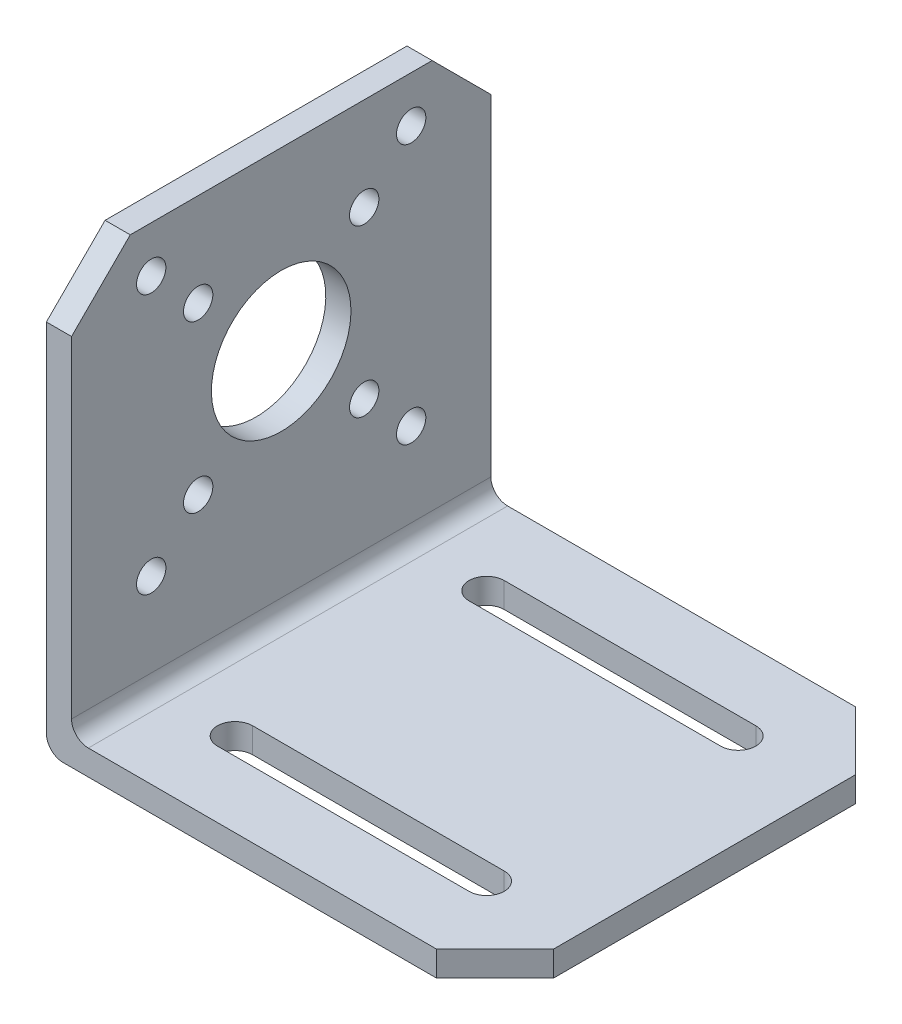
ISO-10303-21;
HEADER;
FILE_DESCRIPTION(('STEP AP214'),'2;1');
FILE_NAME('part.step','',(''),(''),'','','');
FILE_SCHEMA(('AUTOMOTIVE_DESIGN { 1 0 10303 214 1 1 1 1 }'));
ENDSEC;
DATA;
#1=APPLICATION_CONTEXT('core data for automotive mechanical design processes');
#2=APPLICATION_PROTOCOL_DEFINITION('international standard','automotive_design',2000,#1);
#3=PRODUCT_CONTEXT('',#1,'mechanical');
#4=PRODUCT('Part','Part','',(#3));
#5=PRODUCT_RELATED_PRODUCT_CATEGORY('part','',(#4));
#6=PRODUCT_DEFINITION_FORMATION('','',#4);
#7=PRODUCT_DEFINITION_CONTEXT('part definition',#1,'design');
#8=PRODUCT_DEFINITION('design','',#6,#7);
#9=PRODUCT_DEFINITION_SHAPE('','',#8);
#10=(LENGTH_UNIT() NAMED_UNIT(*) SI_UNIT(.MILLI.,.METRE.));
#11=(NAMED_UNIT(*) PLANE_ANGLE_UNIT() SI_UNIT($,.RADIAN.));
#12=(NAMED_UNIT(*) SI_UNIT($,.STERADIAN.) SOLID_ANGLE_UNIT());
#13=UNCERTAINTY_MEASURE_WITH_UNIT(LENGTH_MEASURE(1.E-05),#10,'distance_accuracy_value','');
#14=(GEOMETRIC_REPRESENTATION_CONTEXT(3) GLOBAL_UNCERTAINTY_ASSIGNED_CONTEXT((#13)) GLOBAL_UNIT_ASSIGNED_CONTEXT((#10,
#11,#12)) REPRESENTATION_CONTEXT('',''));
#15=CARTESIAN_POINT('',(0.,0.,0.));
#16=DIRECTION('',(0.,0.,1.));
#17=DIRECTION('',(1.,0.,0.));
#18=AXIS2_PLACEMENT_3D('',#15,#16,#17);
#19=CARTESIAN_POINT('',(0.,51.5,50.));
#20=DIRECTION('',(0.,1.,0.));
#21=DIRECTION('',(0.,0.,1.));
#22=AXIS2_PLACEMENT_3D('',#19,#20,#21);
#23=PLANE('',#22);
#24=DIRECTION('',(0.,0.,-1.));
#25=VECTOR('',#24,1.);
#26=CARTESIAN_POINT('',(0.,51.5,50.));
#27=LINE('',#26,#25);
#28=CARTESIAN_POINT('',(0.,51.5,43.));
#29=VERTEX_POINT('',#28);
#30=CARTESIAN_POINT('',(0.,51.5,7.00000000000003));
#31=VERTEX_POINT('',#30);
#32=EDGE_CURVE('E325',#29,#31,#27,.T.);
#33=ORIENTED_EDGE('',*,*,#32,.F.);
#34=DIRECTION('',(1.,0.,0.));
#35=VECTOR('',#34,1.);
#36=CARTESIAN_POINT('',(3.,51.5,43.));
#37=LINE('',#36,#35);
#38=CARTESIAN_POINT('',(3.,51.5,43.));
#39=VERTEX_POINT('',#38);
#40=EDGE_CURVE('E375',#29,#39,#37,.T.);
#41=ORIENTED_EDGE('',*,*,#40,.T.);
#42=DIRECTION('',(0.,0.,-1.));
#43=VECTOR('',#42,1.);
#44=CARTESIAN_POINT('',(3.,51.5,50.));
#45=LINE('',#44,#43);
#46=CARTESIAN_POINT('',(3.,51.5,7.00000000000003));
#47=VERTEX_POINT('',#46);
#48=EDGE_CURVE('E310',#39,#47,#45,.T.);
#49=ORIENTED_EDGE('',*,*,#48,.T.);
#50=DIRECTION('',(-1.,0.,0.));
#51=VECTOR('',#50,1.);
#52=CARTESIAN_POINT('',(0.,51.5,7.00000000000003));
#53=LINE('',#52,#51);
#54=EDGE_CURVE('E350',#47,#31,#53,.T.);
#55=ORIENTED_EDGE('',*,*,#54,.T.);
#56=EDGE_LOOP('',(#33,#41,#49,#55));
#57=FACE_BOUND('',#56,.T.);
#58=ADVANCED_FACE('F32',(#57),#23,.T.);
#59=CARTESIAN_POINT('',(0.,51.5,50.));
#60=DIRECTION('',(1.,0.,0.));
#61=DIRECTION('',(0.,1.,0.));
#62=AXIS2_PLACEMENT_3D('',#59,#60,#61);
#63=PLANE('',#62);
#64=CARTESIAN_POINT('',(0.,40.3994949366116,34.8994949366117));
#65=DIRECTION('',(1.,0.,0.));
#66=DIRECTION('',(0.,1.,0.));
#67=AXIS2_PLACEMENT_3D('',#64,#65,#66);
#68=CIRCLE('',#67,1.75);
#69=CARTESIAN_POINT('',(0.,42.1494949366116,34.8994949366117));
#70=VERTEX_POINT('',#69);
#71=EDGE_CURVE('E263',#70,#70,#68,.T.);
#72=ORIENTED_EDGE('',*,*,#71,.T.);
#73=EDGE_LOOP('',(#72));
#74=FACE_BOUND('',#73,.T.);
#75=CARTESIAN_POINT('',(0.,40.3994949366116,15.1005050633883));
#76=DIRECTION('',(1.,0.,0.));
#77=DIRECTION('',(0.,-1.,0.));
#78=AXIS2_PLACEMENT_3D('',#75,#76,#77);
#79=CIRCLE('',#78,1.75);
#80=CARTESIAN_POINT('',(0.,38.6494949366116,15.1005050633883));
#81=VERTEX_POINT('',#80);
#82=EDGE_CURVE('E270',#81,#81,#79,.T.);
#83=ORIENTED_EDGE('',*,*,#82,.T.);
#84=EDGE_LOOP('',(#83));
#85=FACE_BOUND('',#84,.T.);
#86=CARTESIAN_POINT('',(0.,20.6005050633884,15.1005050633883));
#87=DIRECTION('',(1.,0.,0.));
#88=DIRECTION('',(0.,1.,0.));
#89=AXIS2_PLACEMENT_3D('',#86,#87,#88);
#90=CIRCLE('',#89,1.75);
#91=CARTESIAN_POINT('',(0.,22.3505050633884,15.1005050633883));
#92=VERTEX_POINT('',#91);
#93=EDGE_CURVE('E276',#92,#92,#90,.T.);
#94=ORIENTED_EDGE('',*,*,#93,.T.);
#95=EDGE_LOOP('',(#94));
#96=FACE_BOUND('',#95,.T.);
#97=CARTESIAN_POINT('',(0.,20.6005050633884,34.8994949366117));
#98=DIRECTION('',(1.,0.,0.));
#99=DIRECTION('',(0.,-1.,0.));
#100=AXIS2_PLACEMENT_3D('',#97,#98,#99);
#101=CIRCLE('',#100,1.75);
#102=CARTESIAN_POINT('',(0.,18.8505050633884,34.8994949366117));
#103=VERTEX_POINT('',#102);
#104=EDGE_CURVE('E282',#103,#103,#101,.T.);
#105=ORIENTED_EDGE('',*,*,#104,.T.);
#106=EDGE_LOOP('',(#105));
#107=FACE_BOUND('',#106,.T.);
#108=CARTESIAN_POINT('',(0.,45.9999999999998,40.5));
#109=DIRECTION('',(1.,0.,0.));
#110=DIRECTION('',(0.,1.,0.));
#111=AXIS2_PLACEMENT_3D('',#108,#109,#110);
#112=CIRCLE('',#111,1.75);
#113=CARTESIAN_POINT('',(0.,47.7499999999998,40.5));
#114=VERTEX_POINT('',#113);
#115=EDGE_CURVE('E239',#114,#114,#112,.T.);
#116=ORIENTED_EDGE('',*,*,#115,.T.);
#117=EDGE_LOOP('',(#116));
#118=FACE_BOUND('',#117,.T.);
#119=CARTESIAN_POINT('',(0.,45.9999999999998,9.5));
#120=DIRECTION('',(1.,0.,0.));
#121=DIRECTION('',(0.,-1.,0.));
#122=AXIS2_PLACEMENT_3D('',#119,#120,#121);
#123=CIRCLE('',#122,1.75);
#124=CARTESIAN_POINT('',(0.,44.2499999999998,9.5));
#125=VERTEX_POINT('',#124);
#126=EDGE_CURVE('E246',#125,#125,#123,.T.);
#127=ORIENTED_EDGE('',*,*,#126,.T.);
#128=EDGE_LOOP('',(#127));
#129=FACE_BOUND('',#128,.T.);
#130=CARTESIAN_POINT('',(0.,15.0000000000002,40.5));
#131=DIRECTION('',(1.,0.,0.));
#132=DIRECTION('',(0.,-1.,0.));
#133=AXIS2_PLACEMENT_3D('',#130,#131,#132);
#134=CIRCLE('',#133,1.75000000000001);
#135=CARTESIAN_POINT('',(0.,13.2500000000002,40.5));
#136=VERTEX_POINT('',#135);
#137=EDGE_CURVE('E252',#136,#136,#134,.T.);
#138=ORIENTED_EDGE('',*,*,#137,.T.);
#139=EDGE_LOOP('',(#138));
#140=FACE_BOUND('',#139,.T.);
#141=CARTESIAN_POINT('',(0.,15.0000000000002,9.5));
#142=DIRECTION('',(1.,0.,0.));
#143=DIRECTION('',(0.,1.,0.));
#144=AXIS2_PLACEMENT_3D('',#141,#142,#143);
#145=CIRCLE('',#144,1.75);
#146=CARTESIAN_POINT('',(0.,16.7500000000002,9.5));
#147=VERTEX_POINT('',#146);
#148=EDGE_CURVE('E258',#147,#147,#145,.T.);
#149=ORIENTED_EDGE('',*,*,#148,.T.);
#150=EDGE_LOOP('',(#149));
#151=FACE_BOUND('',#150,.T.);
#152=CARTESIAN_POINT('',(0.,30.5,25.));
#153=DIRECTION('',(1.,0.,0.));
#154=DIRECTION('',(0.,1.,0.));
#155=AXIS2_PLACEMENT_3D('',#152,#153,#154);
#156=CIRCLE('',#155,8.32007499365595);
#157=CARTESIAN_POINT('',(0.,38.8200749936559,25.));
#158=VERTEX_POINT('',#157);
#159=EDGE_CURVE('E287',#158,#158,#156,.T.);
#160=ORIENTED_EDGE('',*,*,#159,.T.);
#161=EDGE_LOOP('',(#160));
#162=FACE_BOUND('',#161,.T.);
#163=DIRECTION('',(0.,-1.,0.));
#164=VECTOR('',#163,1.);
#165=CARTESIAN_POINT('',(0.,51.5,50.));
#166=LINE('',#165,#164);
#167=CARTESIAN_POINT('',(0.,44.5,50.));
#168=VERTEX_POINT('',#167);
#169=CARTESIAN_POINT('',(0.,2.,50.));
#170=VERTEX_POINT('',#169);
#171=EDGE_CURVE('E308',#168,#170,#166,.T.);
#172=ORIENTED_EDGE('',*,*,#171,.F.);
#173=DIRECTION('',(0.,0.707106781186549,-0.707106781186546));
#174=VECTOR('',#173,1.);
#175=CARTESIAN_POINT('',(0.,51.5,43.));
#176=LINE('',#175,#174);
#177=EDGE_CURVE('E11',#168,#29,#176,.T.);
#178=ORIENTED_EDGE('',*,*,#177,.T.);
#179=ORIENTED_EDGE('',*,*,#32,.T.);
#180=DIRECTION('',(0.,0.707106781186546,0.707106781186549));
#181=VECTOR('',#180,1.);
#182=CARTESIAN_POINT('',(0.,44.5,0.));
#183=LINE('',#182,#181);
#184=CARTESIAN_POINT('',(0.,44.5,0.));
#185=VERTEX_POINT('',#184);
#186=EDGE_CURVE('E353',#31,#185,#183,.F.);
#187=ORIENTED_EDGE('',*,*,#186,.T.);
#188=DIRECTION('',(0.,-1.,0.));
#189=VECTOR('',#188,1.);
#190=CARTESIAN_POINT('',(0.,51.5,0.));
#191=LINE('',#190,#189);
#192=CARTESIAN_POINT('',(0.,2.,0.));
#193=VERTEX_POINT('',#192);
#194=EDGE_CURVE('E296',#185,#193,#191,.T.);
#195=ORIENTED_EDGE('',*,*,#194,.T.);
#196=DIRECTION('',(0.,0.,-1.));
#197=VECTOR('',#196,1.);
#198=CARTESIAN_POINT('',(0.,2.,50.));
#199=LINE('',#198,#197);
#200=EDGE_CURVE('E328',#170,#193,#199,.T.);
#201=ORIENTED_EDGE('',*,*,#200,.F.);
#202=EDGE_LOOP('',(#172,#178,#179,#187,#195,#201));
#203=FACE_BOUND('',#202,.T.);
#204=ADVANCED_FACE('F393',(#74,#85,#96,#107,#118,#129,#140,#151,#162,#203),#63,.F.);
#205=CARTESIAN_POINT('',(2.00000000000001,2.,50.));
#206=DIRECTION('',(0.,0.,-1.));
#207=DIRECTION('',(-1.,0.,0.));
#208=AXIS2_PLACEMENT_3D('',#205,#206,#207);
#209=CYLINDRICAL_SURFACE('',#208,2.);
#210=CARTESIAN_POINT('',(2.00000000000001,2.,0.));
#211=DIRECTION('',(0.,0.,-1.));
#212=DIRECTION('',(-1.,0.,0.));
#213=AXIS2_PLACEMENT_3D('',#210,#211,#212);
#214=CIRCLE('',#213,2.);
#215=CARTESIAN_POINT('',(2.00000000000001,0.,0.));
#216=VERTEX_POINT('',#215);
#217=EDGE_CURVE('E321',#216,#193,#214,.T.);
#218=ORIENTED_EDGE('',*,*,#217,.F.);
#219=DIRECTION('',(0.,0.,-1.));
#220=VECTOR('',#219,1.);
#221=CARTESIAN_POINT('',(2.00000000000001,0.,50.));
#222=LINE('',#221,#220);
#223=CARTESIAN_POINT('',(2.00000000000001,0.,50.));
#224=VERTEX_POINT('',#223);
#225=EDGE_CURVE('E331',#224,#216,#222,.T.);
#226=ORIENTED_EDGE('',*,*,#225,.F.);
#227=CARTESIAN_POINT('',(2.00000000000001,2.,50.));
#228=DIRECTION('',(0.,0.,-1.));
#229=DIRECTION('',(-1.,0.,0.));
#230=AXIS2_PLACEMENT_3D('',#227,#228,#229);
#231=CIRCLE('',#230,2.);
#232=EDGE_CURVE('E305',#224,#170,#231,.T.);
#233=ORIENTED_EDGE('',*,*,#232,.T.);
#234=ORIENTED_EDGE('',*,*,#200,.T.);
#235=EDGE_LOOP('',(#218,#226,#233,#234));
#236=FACE_BOUND('',#235,.T.);
#237=ADVANCED_FACE('F408',(#236),#209,.T.);
#238=CARTESIAN_POINT('',(2.00000000000001,0.,50.));
#239=DIRECTION('',(0.,1.,0.));
#240=DIRECTION('',(0.,0.,1.));
#241=AXIS2_PLACEMENT_3D('',#238,#239,#240);
#242=PLANE('',#241);
#243=DIRECTION('',(-1.,0.,0.));
#244=VECTOR('',#243,1.);
#245=CARTESIAN_POINT('',(2.00000000000001,0.,7.9));
#246=LINE('',#245,#244);
#247=CARTESIAN_POINT('',(42.5,0.,7.90000000000001));
#248=VERTEX_POINT('',#247);
#249=CARTESIAN_POINT('',(12.5,0.,7.9));
#250=VERTEX_POINT('',#249);
#251=EDGE_CURVE('E232',#248,#250,#246,.T.);
#252=ORIENTED_EDGE('',*,*,#251,.T.);
#253=CARTESIAN_POINT('',(12.5,0.,10.));
#254=DIRECTION('',(0.,1.,0.));
#255=DIRECTION('',(0.,0.,1.));
#256=AXIS2_PLACEMENT_3D('',#253,#254,#255);
#257=CIRCLE('',#256,2.1);
#258=CARTESIAN_POINT('',(12.5,0.,12.1));
#259=VERTEX_POINT('',#258);
#260=EDGE_CURVE('E235',#250,#259,#257,.T.);
#261=ORIENTED_EDGE('',*,*,#260,.T.);
#262=DIRECTION('',(1.,0.,0.));
#263=VECTOR('',#262,1.);
#264=CARTESIAN_POINT('',(2.00000000000001,0.,12.1));
#265=LINE('',#264,#263);
#266=CARTESIAN_POINT('',(42.5,0.,12.1));
#267=VERTEX_POINT('',#266);
#268=EDGE_CURVE('E229',#259,#267,#265,.T.);
#269=ORIENTED_EDGE('',*,*,#268,.T.);
#270=CARTESIAN_POINT('',(42.5,0.,10.));
#271=DIRECTION('',(0.,1.,0.));
#272=DIRECTION('',(0.,0.,1.));
#273=AXIS2_PLACEMENT_3D('',#270,#271,#272);
#274=CIRCLE('',#273,2.1);
#275=EDGE_CURVE('E173',#267,#248,#274,.T.);
#276=ORIENTED_EDGE('',*,*,#275,.T.);
#277=EDGE_LOOP('',(#252,#261,#269,#276));
#278=FACE_BOUND('',#277,.T.);
#279=DIRECTION('',(-1.,0.,0.));
#280=VECTOR('',#279,1.);
#281=CARTESIAN_POINT('',(2.00000000000001,0.,37.9));
#282=LINE('',#281,#280);
#283=CARTESIAN_POINT('',(42.5,0.,37.9));
#284=VERTEX_POINT('',#283);
#285=CARTESIAN_POINT('',(12.5,0.,37.9));
#286=VERTEX_POINT('',#285);
#287=EDGE_CURVE('E223',#284,#286,#282,.T.);
#288=ORIENTED_EDGE('',*,*,#287,.T.);
#289=CARTESIAN_POINT('',(12.5,0.,40.));
#290=DIRECTION('',(0.,1.,0.));
#291=DIRECTION('',(0.,0.,1.));
#292=AXIS2_PLACEMENT_3D('',#289,#290,#291);
#293=CIRCLE('',#292,2.1);
#294=CARTESIAN_POINT('',(12.5,0.,42.1));
#295=VERTEX_POINT('',#294);
#296=EDGE_CURVE('E226',#286,#295,#293,.T.);
#297=ORIENTED_EDGE('',*,*,#296,.T.);
#298=DIRECTION('',(1.,0.,0.));
#299=VECTOR('',#298,1.);
#300=CARTESIAN_POINT('',(2.00000000000001,0.,42.1));
#301=LINE('',#300,#299);
#302=CARTESIAN_POINT('',(42.5,0.,42.1));
#303=VERTEX_POINT('',#302);
#304=EDGE_CURVE('E197',#295,#303,#301,.T.);
#305=ORIENTED_EDGE('',*,*,#304,.T.);
#306=CARTESIAN_POINT('',(42.5,0.,40.));
#307=DIRECTION('',(0.,1.,0.));
#308=DIRECTION('',(0.,0.,1.));
#309=AXIS2_PLACEMENT_3D('',#306,#307,#308);
#310=CIRCLE('',#309,2.1);
#311=EDGE_CURVE('E220',#303,#284,#310,.T.);
#312=ORIENTED_EDGE('',*,*,#311,.T.);
#313=EDGE_LOOP('',(#288,#297,#305,#312));
#314=FACE_BOUND('',#313,.T.);
#315=DIRECTION('',(1.,0.,0.));
#316=VECTOR('',#315,1.);
#317=CARTESIAN_POINT('',(2.00000000000001,0.,0.));
#318=LINE('',#317,#316);
#319=CARTESIAN_POINT('',(46.5,0.,0.));
#320=VERTEX_POINT('',#319);
#321=EDGE_CURVE('E318',#216,#320,#318,.T.);
#322=ORIENTED_EDGE('',*,*,#321,.T.);
#323=DIRECTION('',(-0.707106781186546,0.,-0.707106781186549));
#324=VECTOR('',#323,1.);
#325=CARTESIAN_POINT('',(46.5,0.,0.));
#326=LINE('',#325,#324);
#327=CARTESIAN_POINT('',(53.5,0.,7.00000000000003));
#328=VERTEX_POINT('',#327);
#329=EDGE_CURVE('E360',#320,#328,#326,.F.);
#330=ORIENTED_EDGE('',*,*,#329,.T.);
#331=DIRECTION('',(0.,0.,-1.));
#332=VECTOR('',#331,1.);
#333=CARTESIAN_POINT('',(53.5,0.,50.));
#334=LINE('',#333,#332);
#335=CARTESIAN_POINT('',(53.5,0.,43.));
#336=VERTEX_POINT('',#335);
#337=EDGE_CURVE('E333',#336,#328,#334,.T.);
#338=ORIENTED_EDGE('',*,*,#337,.F.);
#339=DIRECTION('',(-0.707106781186549,0.,0.707106781186546));
#340=VECTOR('',#339,1.);
#341=CARTESIAN_POINT('',(53.5,0.,43.));
#342=LINE('',#341,#340);
#343=CARTESIAN_POINT('',(46.5,0.,50.));
#344=VERTEX_POINT('',#343);
#345=EDGE_CURVE('E358',#336,#344,#342,.T.);
#346=ORIENTED_EDGE('',*,*,#345,.T.);
#347=DIRECTION('',(1.,0.,0.));
#348=VECTOR('',#347,1.);
#349=CARTESIAN_POINT('',(2.00000000000001,0.,50.));
#350=LINE('',#349,#348);
#351=EDGE_CURVE('E302',#224,#344,#350,.T.);
#352=ORIENTED_EDGE('',*,*,#351,.F.);
#353=ORIENTED_EDGE('',*,*,#225,.T.);
#354=EDGE_LOOP('',(#322,#330,#338,#346,#352,#353));
#355=FACE_BOUND('',#354,.T.);
#356=ADVANCED_FACE('F514',(#278,#314,#355),#242,.F.);
#357=CARTESIAN_POINT('',(53.5,3.,50.));
#358=DIRECTION('',(1.,0.,0.));
#359=DIRECTION('',(0.,0.,-1.));
#360=AXIS2_PLACEMENT_3D('',#357,#358,#359);
#361=PLANE('',#360);
#362=ORIENTED_EDGE('',*,*,#337,.T.);
#363=DIRECTION('',(0.,1.,0.));
#364=VECTOR('',#363,1.);
#365=CARTESIAN_POINT('',(53.5,3.,7.00000000000003));
#366=LINE('',#365,#364);
#367=CARTESIAN_POINT('',(53.5,3.,7.00000000000003));
#368=VERTEX_POINT('',#367);
#369=EDGE_CURVE('E365',#328,#368,#366,.T.);
#370=ORIENTED_EDGE('',*,*,#369,.T.);
#371=DIRECTION('',(0.,0.,-1.));
#372=VECTOR('',#371,1.);
#373=CARTESIAN_POINT('',(53.5,3.,50.));
#374=LINE('',#373,#372);
#375=CARTESIAN_POINT('',(53.5,3.,43.));
#376=VERTEX_POINT('',#375);
#377=EDGE_CURVE('E336',#376,#368,#374,.T.);
#378=ORIENTED_EDGE('',*,*,#377,.F.);
#379=DIRECTION('',(0.,-1.,0.));
#380=VECTOR('',#379,1.);
#381=CARTESIAN_POINT('',(53.5,0.,43.));
#382=LINE('',#381,#380);
#383=EDGE_CURVE('E362',#376,#336,#382,.T.);
#384=ORIENTED_EDGE('',*,*,#383,.T.);
#385=EDGE_LOOP('',(#362,#370,#378,#384));
#386=FACE_BOUND('',#385,.T.);
#387=ADVANCED_FACE('F421',(#386),#361,.T.);
#388=CARTESIAN_POINT('',(5.,2.99999999999997,50.));
#389=DIRECTION('',(0.,1.,0.));
#390=DIRECTION('',(-1.,0.,0.));
#391=AXIS2_PLACEMENT_3D('',#388,#389,#390);
#392=PLANE('',#391);
#393=CARTESIAN_POINT('',(12.5,2.99999999999998,10.));
#394=DIRECTION('',(0.,1.,0.));
#395=DIRECTION('',(-1.,0.,0.));
#396=AXIS2_PLACEMENT_3D('',#393,#394,#395);
#397=CIRCLE('',#396,2.1);
#398=CARTESIAN_POINT('',(12.5,2.99999999999998,7.9));
#399=VERTEX_POINT('',#398);
#400=CARTESIAN_POINT('',(12.5,2.99999999999998,12.1));
#401=VERTEX_POINT('',#400);
#402=EDGE_CURVE('E185',#399,#401,#397,.T.);
#403=ORIENTED_EDGE('',*,*,#402,.F.);
#404=DIRECTION('',(-1.,0.,0.));
#405=VECTOR('',#404,1.);
#406=CARTESIAN_POINT('',(12.5,2.99999999999998,7.9));
#407=LINE('',#406,#405);
#408=CARTESIAN_POINT('',(42.5,2.99999999999999,7.90000000000001));
#409=VERTEX_POINT('',#408);
#410=EDGE_CURVE('E190',#409,#399,#407,.T.);
#411=ORIENTED_EDGE('',*,*,#410,.F.);
#412=CARTESIAN_POINT('',(42.5,2.99999999999999,10.));
#413=DIRECTION('',(0.,1.,0.));
#414=DIRECTION('',(-1.,0.,0.));
#415=AXIS2_PLACEMENT_3D('',#412,#413,#414);
#416=CIRCLE('',#415,2.1);
#417=CARTESIAN_POINT('',(42.5,2.99999999999999,12.1));
#418=VERTEX_POINT('',#417);
#419=EDGE_CURVE('E170',#418,#409,#416,.T.);
#420=ORIENTED_EDGE('',*,*,#419,.F.);
#421=DIRECTION('',(1.,0.,0.));
#422=VECTOR('',#421,1.);
#423=CARTESIAN_POINT('',(12.5,2.99999999999998,12.1));
#424=LINE('',#423,#422);
#425=EDGE_CURVE('E180',#401,#418,#424,.T.);
#426=ORIENTED_EDGE('',*,*,#425,.F.);
#427=EDGE_LOOP('',(#403,#411,#420,#426));
#428=FACE_BOUND('',#427,.T.);
#429=CARTESIAN_POINT('',(12.5,2.99999999999998,40.));
#430=DIRECTION('',(0.,1.,0.));
#431=DIRECTION('',(1.,0.,0.));
#432=AXIS2_PLACEMENT_3D('',#429,#430,#431);
#433=CIRCLE('',#432,2.1);
#434=CARTESIAN_POINT('',(12.5,2.99999999999998,37.9));
#435=VERTEX_POINT('',#434);
#436=CARTESIAN_POINT('',(12.5,2.99999999999998,42.1));
#437=VERTEX_POINT('',#436);
#438=EDGE_CURVE('E200',#435,#437,#433,.T.);
#439=ORIENTED_EDGE('',*,*,#438,.F.);
#440=DIRECTION('',(-1.,0.,0.));
#441=VECTOR('',#440,1.);
#442=CARTESIAN_POINT('',(12.5,2.99999999999998,37.9));
#443=LINE('',#442,#441);
#444=CARTESIAN_POINT('',(42.5,2.99999999999999,37.9));
#445=VERTEX_POINT('',#444);
#446=EDGE_CURVE('E207',#445,#435,#443,.T.);
#447=ORIENTED_EDGE('',*,*,#446,.F.);
#448=CARTESIAN_POINT('',(42.5,2.99999999999999,40.));
#449=DIRECTION('',(0.,1.,0.));
#450=DIRECTION('',(1.,0.,0.));
#451=AXIS2_PLACEMENT_3D('',#448,#449,#450);
#452=CIRCLE('',#451,2.1);
#453=CARTESIAN_POINT('',(42.5,2.99999999999999,42.1));
#454=VERTEX_POINT('',#453);
#455=EDGE_CURVE('E204',#454,#445,#452,.T.);
#456=ORIENTED_EDGE('',*,*,#455,.F.);
#457=DIRECTION('',(1.,0.,0.));
#458=VECTOR('',#457,1.);
#459=CARTESIAN_POINT('',(12.5,2.99999999999998,42.1));
#460=LINE('',#459,#458);
#461=EDGE_CURVE('E202',#437,#454,#460,.T.);
#462=ORIENTED_EDGE('',*,*,#461,.F.);
#463=EDGE_LOOP('',(#439,#447,#456,#462));
#464=FACE_BOUND('',#463,.T.);
#465=ORIENTED_EDGE('',*,*,#377,.T.);
#466=DIRECTION('',(0.707106781186546,0.,0.707106781186549));
#467=VECTOR('',#466,1.);
#468=CARTESIAN_POINT('',(50.7500000000001,3.,4.25000000000011));
#469=LINE('',#468,#467);
#470=CARTESIAN_POINT('',(46.5,3.,0.));
#471=VERTEX_POINT('',#470);
#472=EDGE_CURVE('E369',#368,#471,#469,.F.);
#473=ORIENTED_EDGE('',*,*,#472,.T.);
#474=DIRECTION('',(1.,0.,0.));
#475=VECTOR('',#474,1.);
#476=CARTESIAN_POINT('',(5.,2.99999999999997,0.));
#477=LINE('',#476,#475);
#478=CARTESIAN_POINT('',(5.,2.99999999999997,0.));
#479=VERTEX_POINT('',#478);
#480=EDGE_CURVE('E315',#479,#471,#477,.T.);
#481=ORIENTED_EDGE('',*,*,#480,.F.);
#482=DIRECTION('',(0.,0.,-1.));
#483=VECTOR('',#482,1.);
#484=CARTESIAN_POINT('',(5.,2.99999999999997,50.));
#485=LINE('',#484,#483);
#486=CARTESIAN_POINT('',(5.,2.99999999999997,50.));
#487=VERTEX_POINT('',#486);
#488=EDGE_CURVE('E339',#487,#479,#485,.T.);
#489=ORIENTED_EDGE('',*,*,#488,.F.);
#490=DIRECTION('',(1.,0.,0.));
#491=VECTOR('',#490,1.);
#492=CARTESIAN_POINT('',(5.,2.99999999999997,50.));
#493=LINE('',#492,#491);
#494=CARTESIAN_POINT('',(46.5,3.,50.));
#495=VERTEX_POINT('',#494);
#496=EDGE_CURVE('E299',#487,#495,#493,.T.);
#497=ORIENTED_EDGE('',*,*,#496,.T.);
#498=DIRECTION('',(0.707106781186549,0.,-0.707106781186546));
#499=VECTOR('',#498,1.);
#500=CARTESIAN_POINT('',(25.7499999999999,2.99999999999998,70.75));
#501=LINE('',#500,#499);
#502=EDGE_CURVE('E367',#495,#376,#501,.T.);
#503=ORIENTED_EDGE('',*,*,#502,.T.);
#504=EDGE_LOOP('',(#465,#473,#481,#489,#497,#503));
#505=FACE_BOUND('',#504,.T.);
#506=ADVANCED_FACE('F187',(#428,#464,#505),#392,.T.);
#507=CARTESIAN_POINT('',(5.,4.99999999999997,50.));
#508=DIRECTION('',(0.,0.,-1.));
#509=DIRECTION('',(-1.,0.,0.));
#510=AXIS2_PLACEMENT_3D('',#507,#508,#509);
#511=CYLINDRICAL_SURFACE('',#510,2.);
#512=CARTESIAN_POINT('',(5.,4.99999999999997,0.));
#513=DIRECTION('',(0.,0.,-1.));
#514=DIRECTION('',(-1.,0.,0.));
#515=AXIS2_PLACEMENT_3D('',#512,#513,#514);
#516=CIRCLE('',#515,2.);
#517=CARTESIAN_POINT('',(3.00000000000001,4.99999999999997,0.));
#518=VERTEX_POINT('',#517);
#519=EDGE_CURVE('E312',#479,#518,#516,.T.);
#520=ORIENTED_EDGE('',*,*,#519,.T.);
#521=DIRECTION('',(0.,0.,-1.));
#522=VECTOR('',#521,1.);
#523=CARTESIAN_POINT('',(3.00000000000001,4.99999999999997,50.));
#524=LINE('',#523,#522);
#525=CARTESIAN_POINT('',(3.00000000000001,4.99999999999997,50.));
#526=VERTEX_POINT('',#525);
#527=EDGE_CURVE('E341',#526,#518,#524,.T.);
#528=ORIENTED_EDGE('',*,*,#527,.F.);
#529=CARTESIAN_POINT('',(5.,4.99999999999997,50.));
#530=DIRECTION('',(0.,0.,-1.));
#531=DIRECTION('',(-1.,0.,0.));
#532=AXIS2_PLACEMENT_3D('',#529,#530,#531);
#533=CIRCLE('',#532,2.);
#534=EDGE_CURVE('E295',#487,#526,#533,.T.);
#535=ORIENTED_EDGE('',*,*,#534,.F.);
#536=ORIENTED_EDGE('',*,*,#488,.T.);
#537=EDGE_LOOP('',(#520,#528,#535,#536));
#538=FACE_BOUND('',#537,.T.);
#539=ADVANCED_FACE('F430',(#538),#511,.F.);
#540=CARTESIAN_POINT('',(3.,51.5,50.));
#541=DIRECTION('',(1.,0.,0.));
#542=DIRECTION('',(0.,1.,0.));
#543=AXIS2_PLACEMENT_3D('',#540,#541,#542);
#544=PLANE('',#543);
#545=CARTESIAN_POINT('',(3.,40.3994949366116,34.8994949366117));
#546=DIRECTION('',(1.,0.,0.));
#547=DIRECTION('',(0.,1.,0.));
#548=AXIS2_PLACEMENT_3D('',#545,#546,#547);
#549=CIRCLE('',#548,1.75);
#550=CARTESIAN_POINT('',(3.,42.1494949366116,34.8994949366117));
#551=VERTEX_POINT('',#550);
#552=EDGE_CURVE('E267',#551,#551,#549,.T.);
#553=ORIENTED_EDGE('',*,*,#552,.F.);
#554=EDGE_LOOP('',(#553));
#555=FACE_BOUND('',#554,.T.);
#556=CARTESIAN_POINT('',(3.,40.3994949366116,15.1005050633883));
#557=DIRECTION('',(1.,0.,0.));
#558=DIRECTION('',(0.,-1.,0.));
#559=AXIS2_PLACEMENT_3D('',#556,#557,#558);
#560=CIRCLE('',#559,1.75);
#561=CARTESIAN_POINT('',(3.,38.6494949366116,15.1005050633883));
#562=VERTEX_POINT('',#561);
#563=EDGE_CURVE('E273',#562,#562,#560,.T.);
#564=ORIENTED_EDGE('',*,*,#563,.F.);
#565=EDGE_LOOP('',(#564));
#566=FACE_BOUND('',#565,.T.);
#567=CARTESIAN_POINT('',(3.,20.6005050633884,15.1005050633883));
#568=DIRECTION('',(1.,0.,0.));
#569=DIRECTION('',(0.,1.,0.));
#570=AXIS2_PLACEMENT_3D('',#567,#568,#569);
#571=CIRCLE('',#570,1.75);
#572=CARTESIAN_POINT('',(3.,22.3505050633884,15.1005050633883));
#573=VERTEX_POINT('',#572);
#574=EDGE_CURVE('E279',#573,#573,#571,.T.);
#575=ORIENTED_EDGE('',*,*,#574,.F.);
#576=EDGE_LOOP('',(#575));
#577=FACE_BOUND('',#576,.T.);
#578=CARTESIAN_POINT('',(3.,20.6005050633884,34.8994949366117));
#579=DIRECTION('',(1.,0.,0.));
#580=DIRECTION('',(0.,-1.,0.));
#581=AXIS2_PLACEMENT_3D('',#578,#579,#580);
#582=CIRCLE('',#581,1.75);
#583=CARTESIAN_POINT('',(3.,18.8505050633884,34.8994949366117));
#584=VERTEX_POINT('',#583);
#585=EDGE_CURVE('E242',#584,#584,#582,.T.);
#586=ORIENTED_EDGE('',*,*,#585,.F.);
#587=EDGE_LOOP('',(#586));
#588=FACE_BOUND('',#587,.T.);
#589=CARTESIAN_POINT('',(3.,45.9999999999998,40.5));
#590=DIRECTION('',(1.,0.,0.));
#591=DIRECTION('',(0.,1.,0.));
#592=AXIS2_PLACEMENT_3D('',#589,#590,#591);
#593=CIRCLE('',#592,1.75);
#594=CARTESIAN_POINT('',(3.,47.7499999999998,40.5));
#595=VERTEX_POINT('',#594);
#596=EDGE_CURVE('E243',#595,#595,#593,.T.);
#597=ORIENTED_EDGE('',*,*,#596,.F.);
#598=EDGE_LOOP('',(#597));
#599=FACE_BOUND('',#598,.T.);
#600=CARTESIAN_POINT('',(3.,45.9999999999998,9.5));
#601=DIRECTION('',(1.,0.,0.));
#602=DIRECTION('',(0.,-1.,0.));
#603=AXIS2_PLACEMENT_3D('',#600,#601,#602);
#604=CIRCLE('',#603,1.75);
#605=CARTESIAN_POINT('',(3.,44.2499999999998,9.5));
#606=VERTEX_POINT('',#605);
#607=EDGE_CURVE('E249',#606,#606,#604,.T.);
#608=ORIENTED_EDGE('',*,*,#607,.F.);
#609=EDGE_LOOP('',(#608));
#610=FACE_BOUND('',#609,.T.);
#611=CARTESIAN_POINT('',(3.00000000000001,15.0000000000002,40.5));
#612=DIRECTION('',(1.,0.,0.));
#613=DIRECTION('',(0.,-1.,0.));
#614=AXIS2_PLACEMENT_3D('',#611,#612,#613);
#615=CIRCLE('',#614,1.75000000000001);
#616=CARTESIAN_POINT('',(3.00000000000001,13.2500000000002,40.5));
#617=VERTEX_POINT('',#616);
#618=EDGE_CURVE('E255',#617,#617,#615,.T.);
#619=ORIENTED_EDGE('',*,*,#618,.F.);
#620=EDGE_LOOP('',(#619));
#621=FACE_BOUND('',#620,.T.);
#622=CARTESIAN_POINT('',(3.00000000000001,15.0000000000002,9.5));
#623=DIRECTION('',(1.,0.,0.));
#624=DIRECTION('',(0.,1.,0.));
#625=AXIS2_PLACEMENT_3D('',#622,#623,#624);
#626=CIRCLE('',#625,1.75);
#627=CARTESIAN_POINT('',(3.,16.7500000000002,9.5));
#628=VERTEX_POINT('',#627);
#629=EDGE_CURVE('E238',#628,#628,#626,.T.);
#630=ORIENTED_EDGE('',*,*,#629,.F.);
#631=EDGE_LOOP('',(#630));
#632=FACE_BOUND('',#631,.T.);
#633=CARTESIAN_POINT('',(3.,30.5,25.));
#634=DIRECTION('',(1.,0.,0.));
#635=DIRECTION('',(0.,1.,0.));
#636=AXIS2_PLACEMENT_3D('',#633,#634,#635);
#637=CIRCLE('',#636,8.32007499365595);
#638=CARTESIAN_POINT('',(3.,38.8200749936559,25.));
#639=VERTEX_POINT('',#638);
#640=EDGE_CURVE('E266',#639,#639,#637,.T.);
#641=ORIENTED_EDGE('',*,*,#640,.F.);
#642=EDGE_LOOP('',(#641));
#643=FACE_BOUND('',#642,.T.);
#644=ORIENTED_EDGE('',*,*,#48,.F.);
#645=DIRECTION('',(0.,-0.707106781186549,0.707106781186546));
#646=VECTOR('',#645,1.);
#647=CARTESIAN_POINT('',(3.,48.,46.5));
#648=LINE('',#647,#646);
#649=CARTESIAN_POINT('',(3.,44.5,50.));
#650=VERTEX_POINT('',#649);
#651=EDGE_CURVE('E40',#39,#650,#648,.T.);
#652=ORIENTED_EDGE('',*,*,#651,.T.);
#653=DIRECTION('',(0.,-1.,0.));
#654=VECTOR('',#653,1.);
#655=CARTESIAN_POINT('',(3.,51.5,50.));
#656=LINE('',#655,#654);
#657=EDGE_CURVE('E293',#650,#526,#656,.T.);
#658=ORIENTED_EDGE('',*,*,#657,.T.);
#659=ORIENTED_EDGE('',*,*,#527,.T.);
#660=DIRECTION('',(0.,-1.,0.));
#661=VECTOR('',#660,1.);
#662=CARTESIAN_POINT('',(3.,51.5,0.));
#663=LINE('',#662,#661);
#664=CARTESIAN_POINT('',(3.,44.5,0.));
#665=VERTEX_POINT('',#664);
#666=EDGE_CURVE('E290',#665,#518,#663,.T.);
#667=ORIENTED_EDGE('',*,*,#666,.F.);
#668=DIRECTION('',(0.,-0.707106781186546,-0.707106781186549));
#669=VECTOR('',#668,1.);
#670=CARTESIAN_POINT('',(3.,73.,28.5000000000001));
#671=LINE('',#670,#669);
#672=EDGE_CURVE('E347',#665,#47,#671,.F.);
#673=ORIENTED_EDGE('',*,*,#672,.T.);
#674=EDGE_LOOP('',(#644,#652,#658,#659,#667,#673));
#675=FACE_BOUND('',#674,.T.);
#676=ADVANCED_FACE('F380',(#555,#566,#577,#588,#599,#610,#621,#632,#643,#675),#544,.T.);
#677=CARTESIAN_POINT('',(5.,4.99999999999997,50.));
#678=DIRECTION('',(0.,0.,-1.));
#679=DIRECTION('',(-1.,0.,0.));
#680=AXIS2_PLACEMENT_3D('',#677,#678,#679);
#681=PLANE('',#680);
#682=ORIENTED_EDGE('',*,*,#351,.T.);
#683=DIRECTION('',(0.,1.,0.));
#684=VECTOR('',#683,1.);
#685=CARTESIAN_POINT('',(46.5,3.,50.));
#686=LINE('',#685,#684);
#687=EDGE_CURVE('E373',#344,#495,#686,.T.);
#688=ORIENTED_EDGE('',*,*,#687,.T.);
#689=ORIENTED_EDGE('',*,*,#496,.F.);
#690=ORIENTED_EDGE('',*,*,#534,.T.);
#691=ORIENTED_EDGE('',*,*,#657,.F.);
#692=DIRECTION('',(-1.,0.,0.));
#693=VECTOR('',#692,1.);
#694=CARTESIAN_POINT('',(0.,44.5,50.));
#695=LINE('',#694,#693);
#696=EDGE_CURVE('E371',#650,#168,#695,.T.);
#697=ORIENTED_EDGE('',*,*,#696,.T.);
#698=ORIENTED_EDGE('',*,*,#171,.T.);
#699=ORIENTED_EDGE('',*,*,#232,.F.);
#700=EDGE_LOOP('',(#682,#688,#689,#690,#691,#697,#698,#699));
#701=FACE_BOUND('',#700,.T.);
#702=ADVANCED_FACE('F385',(#701),#681,.F.);
#703=CARTESIAN_POINT('',(5.,4.99999999999997,0.));
#704=DIRECTION('',(0.,0.,-1.));
#705=DIRECTION('',(-1.,0.,0.));
#706=AXIS2_PLACEMENT_3D('',#703,#704,#705);
#707=PLANE('',#706);
#708=ORIENTED_EDGE('',*,*,#480,.T.);
#709=DIRECTION('',(0.,-1.,0.));
#710=VECTOR('',#709,1.);
#711=CARTESIAN_POINT('',(46.5,4.99999999999997,0.));
#712=LINE('',#711,#710);
#713=EDGE_CURVE('E355',#471,#320,#712,.T.);
#714=ORIENTED_EDGE('',*,*,#713,.T.);
#715=ORIENTED_EDGE('',*,*,#321,.F.);
#716=ORIENTED_EDGE('',*,*,#217,.T.);
#717=ORIENTED_EDGE('',*,*,#194,.F.);
#718=DIRECTION('',(1.,0.,0.));
#719=VECTOR('',#718,1.);
#720=CARTESIAN_POINT('',(5.,44.5,0.));
#721=LINE('',#720,#719);
#722=EDGE_CURVE('E327',#185,#665,#721,.T.);
#723=ORIENTED_EDGE('',*,*,#722,.T.);
#724=ORIENTED_EDGE('',*,*,#666,.T.);
#725=ORIENTED_EDGE('',*,*,#519,.F.);
#726=EDGE_LOOP('',(#708,#714,#715,#716,#717,#723,#724,#725));
#727=FACE_BOUND('',#726,.T.);
#728=ADVANCED_FACE('F403',(#727),#707,.T.);
#729=CARTESIAN_POINT('',(0.,30.5,25.));
#730=DIRECTION('',(1.,0.,0.));
#731=DIRECTION('',(0.,1.,0.));
#732=AXIS2_PLACEMENT_3D('',#729,#730,#731);
#733=CYLINDRICAL_SURFACE('',#732,8.32007499365595);
#734=ORIENTED_EDGE('',*,*,#159,.F.);
#735=EDGE_LOOP('',(#734));
#736=FACE_BOUND('',#735,.T.);
#737=ORIENTED_EDGE('',*,*,#640,.T.);
#738=EDGE_LOOP('',(#737));
#739=FACE_BOUND('',#738,.T.);
#740=ADVANCED_FACE('F489',(#736,#739),#733,.F.);
#741=CARTESIAN_POINT('',(0.,15.0000000000002,9.5));
#742=DIRECTION('',(1.,0.,0.));
#743=DIRECTION('',(0.,1.,0.));
#744=AXIS2_PLACEMENT_3D('',#741,#742,#743);
#745=CYLINDRICAL_SURFACE('',#744,1.75);
#746=ORIENTED_EDGE('',*,*,#148,.F.);
#747=EDGE_LOOP('',(#746));
#748=FACE_BOUND('',#747,.T.);
#749=ORIENTED_EDGE('',*,*,#629,.T.);
#750=EDGE_LOOP('',(#749));
#751=FACE_BOUND('',#750,.T.);
#752=ADVANCED_FACE('F485',(#748,#751),#745,.F.);
#753=CARTESIAN_POINT('',(0.,15.0000000000002,40.5));
#754=DIRECTION('',(1.,0.,0.));
#755=DIRECTION('',(0.,1.,0.));
#756=AXIS2_PLACEMENT_3D('',#753,#754,#755);
#757=CYLINDRICAL_SURFACE('',#756,1.75000000000001);
#758=ORIENTED_EDGE('',*,*,#137,.F.);
#759=EDGE_LOOP('',(#758));
#760=FACE_BOUND('',#759,.T.);
#761=ORIENTED_EDGE('',*,*,#618,.T.);
#762=EDGE_LOOP('',(#761));
#763=FACE_BOUND('',#762,.T.);
#764=ADVANCED_FACE('F481',(#760,#763),#757,.F.);
#765=CARTESIAN_POINT('',(0.,45.9999999999998,9.5));
#766=DIRECTION('',(1.,0.,0.));
#767=DIRECTION('',(0.,1.,0.));
#768=AXIS2_PLACEMENT_3D('',#765,#766,#767);
#769=CYLINDRICAL_SURFACE('',#768,1.75);
#770=ORIENTED_EDGE('',*,*,#126,.F.);
#771=EDGE_LOOP('',(#770));
#772=FACE_BOUND('',#771,.T.);
#773=ORIENTED_EDGE('',*,*,#607,.T.);
#774=EDGE_LOOP('',(#773));
#775=FACE_BOUND('',#774,.T.);
#776=ADVANCED_FACE('F477',(#772,#775),#769,.F.);
#777=CARTESIAN_POINT('',(0.,45.9999999999998,40.5));
#778=DIRECTION('',(1.,0.,0.));
#779=DIRECTION('',(0.,1.,0.));
#780=AXIS2_PLACEMENT_3D('',#777,#778,#779);
#781=CYLINDRICAL_SURFACE('',#780,1.75);
#782=ORIENTED_EDGE('',*,*,#115,.F.);
#783=EDGE_LOOP('',(#782));
#784=FACE_BOUND('',#783,.T.);
#785=ORIENTED_EDGE('',*,*,#596,.T.);
#786=EDGE_LOOP('',(#785));
#787=FACE_BOUND('',#786,.T.);
#788=ADVANCED_FACE('F473',(#784,#787),#781,.F.);
#789=CARTESIAN_POINT('',(0.,20.6005050633884,34.8994949366117));
#790=DIRECTION('',(1.,0.,0.));
#791=DIRECTION('',(0.,1.,0.));
#792=AXIS2_PLACEMENT_3D('',#789,#790,#791);
#793=CYLINDRICAL_SURFACE('',#792,1.75);
#794=ORIENTED_EDGE('',*,*,#104,.F.);
#795=EDGE_LOOP('',(#794));
#796=FACE_BOUND('',#795,.T.);
#797=ORIENTED_EDGE('',*,*,#585,.T.);
#798=EDGE_LOOP('',(#797));
#799=FACE_BOUND('',#798,.T.);
#800=ADVANCED_FACE('F476',(#796,#799),#793,.F.);
#801=CARTESIAN_POINT('',(0.,20.6005050633884,15.1005050633883));
#802=DIRECTION('',(1.,0.,0.));
#803=DIRECTION('',(0.,1.,0.));
#804=AXIS2_PLACEMENT_3D('',#801,#802,#803);
#805=CYLINDRICAL_SURFACE('',#804,1.75);
#806=ORIENTED_EDGE('',*,*,#93,.F.);
#807=EDGE_LOOP('',(#806));
#808=FACE_BOUND('',#807,.T.);
#809=ORIENTED_EDGE('',*,*,#574,.T.);
#810=EDGE_LOOP('',(#809));
#811=FACE_BOUND('',#810,.T.);
#812=ADVANCED_FACE('F497',(#808,#811),#805,.F.);
#813=CARTESIAN_POINT('',(0.,40.3994949366116,15.1005050633883));
#814=DIRECTION('',(1.,0.,0.));
#815=DIRECTION('',(0.,1.,0.));
#816=AXIS2_PLACEMENT_3D('',#813,#814,#815);
#817=CYLINDRICAL_SURFACE('',#816,1.75);
#818=ORIENTED_EDGE('',*,*,#82,.F.);
#819=EDGE_LOOP('',(#818));
#820=FACE_BOUND('',#819,.T.);
#821=ORIENTED_EDGE('',*,*,#563,.T.);
#822=EDGE_LOOP('',(#821));
#823=FACE_BOUND('',#822,.T.);
#824=ADVANCED_FACE('F493',(#820,#823),#817,.F.);
#825=CARTESIAN_POINT('',(0.,40.3994949366116,34.8994949366117));
#826=DIRECTION('',(1.,0.,0.));
#827=DIRECTION('',(0.,1.,0.));
#828=AXIS2_PLACEMENT_3D('',#825,#826,#827);
#829=CYLINDRICAL_SURFACE('',#828,1.75);
#830=ORIENTED_EDGE('',*,*,#71,.F.);
#831=EDGE_LOOP('',(#830));
#832=FACE_BOUND('',#831,.T.);
#833=ORIENTED_EDGE('',*,*,#552,.T.);
#834=EDGE_LOOP('',(#833));
#835=FACE_BOUND('',#834,.T.);
#836=ADVANCED_FACE('F450',(#832,#835),#829,.F.);
#837=CARTESIAN_POINT('',(5.,44.5,0.));
#838=DIRECTION('',(0.,-0.707106781186549,0.707106781186546));
#839=DIRECTION('',(1.,0.,0.));
#840=AXIS2_PLACEMENT_3D('',#837,#838,#839);
#841=PLANE('',#840);
#842=ORIENTED_EDGE('',*,*,#186,.F.);
#843=ORIENTED_EDGE('',*,*,#54,.F.);
#844=ORIENTED_EDGE('',*,*,#672,.F.);
#845=ORIENTED_EDGE('',*,*,#722,.F.);
#846=EDGE_LOOP('',(#842,#843,#844,#845));
#847=FACE_BOUND('',#846,.T.);
#848=ADVANCED_FACE('F400',(#847),#841,.F.);
#849=CARTESIAN_POINT('',(46.5,4.99999999999997,0.));
#850=DIRECTION('',(-0.707106781186549,0.,0.707106781186546));
#851=DIRECTION('',(0.,-1.,0.));
#852=AXIS2_PLACEMENT_3D('',#849,#850,#851);
#853=PLANE('',#852);
#854=ORIENTED_EDGE('',*,*,#472,.F.);
#855=ORIENTED_EDGE('',*,*,#369,.F.);
#856=ORIENTED_EDGE('',*,*,#329,.F.);
#857=ORIENTED_EDGE('',*,*,#713,.F.);
#858=EDGE_LOOP('',(#854,#855,#856,#857));
#859=FACE_BOUND('',#858,.T.);
#860=ADVANCED_FACE('F425',(#859),#853,.F.);
#861=CARTESIAN_POINT('',(53.5,3.,43.));
#862=DIRECTION('',(0.707106781186546,0.,0.707106781186549));
#863=DIRECTION('',(0.,1.,0.));
#864=AXIS2_PLACEMENT_3D('',#861,#862,#863);
#865=PLANE('',#864);
#866=ORIENTED_EDGE('',*,*,#502,.F.);
#867=ORIENTED_EDGE('',*,*,#687,.F.);
#868=ORIENTED_EDGE('',*,*,#345,.F.);
#869=ORIENTED_EDGE('',*,*,#383,.F.);
#870=EDGE_LOOP('',(#866,#867,#868,#869));
#871=FACE_BOUND('',#870,.T.);
#872=ADVANCED_FACE('F415',(#871),#865,.T.);
#873=CARTESIAN_POINT('',(0.,51.5,43.));
#874=DIRECTION('',(0.,0.707106781186546,0.707106781186549));
#875=DIRECTION('',(-1.,0.,0.));
#876=AXIS2_PLACEMENT_3D('',#873,#874,#875);
#877=PLANE('',#876);
#878=ORIENTED_EDGE('',*,*,#177,.F.);
#879=ORIENTED_EDGE('',*,*,#696,.F.);
#880=ORIENTED_EDGE('',*,*,#651,.F.);
#881=ORIENTED_EDGE('',*,*,#40,.F.);
#882=EDGE_LOOP('',(#878,#879,#880,#881));
#883=FACE_BOUND('',#882,.T.);
#884=ADVANCED_FACE('F34',(#883),#877,.T.);
#885=CARTESIAN_POINT('',(12.5,-47.,40.));
#886=DIRECTION('',(0.,1.,0.));
#887=DIRECTION('',(-1.,0.,0.));
#888=AXIS2_PLACEMENT_3D('',#885,#886,#887);
#889=CYLINDRICAL_SURFACE('',#888,2.1);
#890=DIRECTION('',(0.,1.,0.));
#891=VECTOR('',#890,1.);
#892=CARTESIAN_POINT('',(12.5,-47.,37.9));
#893=LINE('',#892,#891);
#894=EDGE_CURVE('E211',#286,#435,#893,.T.);
#895=ORIENTED_EDGE('',*,*,#894,.T.);
#896=ORIENTED_EDGE('',*,*,#438,.T.);
#897=DIRECTION('',(0.,1.,0.));
#898=VECTOR('',#897,1.);
#899=CARTESIAN_POINT('',(12.5,-47.,42.1));
#900=LINE('',#899,#898);
#901=EDGE_CURVE('E210',#295,#437,#900,.T.);
#902=ORIENTED_EDGE('',*,*,#901,.F.);
#903=ORIENTED_EDGE('',*,*,#296,.F.);
#904=EDGE_LOOP('',(#895,#896,#902,#903));
#905=FACE_BOUND('',#904,.T.);
#906=ADVANCED_FACE('F456',(#905),#889,.F.);
#907=CARTESIAN_POINT('',(12.5,-47.,37.9));
#908=DIRECTION('',(0.,0.,-1.));
#909=DIRECTION('',(-1.,0.,0.));
#910=AXIS2_PLACEMENT_3D('',#907,#908,#909);
#911=PLANE('',#910);
#912=DIRECTION('',(0.,1.,0.));
#913=VECTOR('',#912,1.);
#914=CARTESIAN_POINT('',(42.5,-47.,37.9));
#915=LINE('',#914,#913);
#916=EDGE_CURVE('E213',#284,#445,#915,.T.);
#917=ORIENTED_EDGE('',*,*,#916,.T.);
#918=ORIENTED_EDGE('',*,*,#446,.T.);
#919=ORIENTED_EDGE('',*,*,#894,.F.);
#920=ORIENTED_EDGE('',*,*,#287,.F.);
#921=EDGE_LOOP('',(#917,#918,#919,#920));
#922=FACE_BOUND('',#921,.T.);
#923=ADVANCED_FACE('F460',(#922),#911,.F.);
#924=CARTESIAN_POINT('',(42.5,-47.,40.));
#925=DIRECTION('',(0.,1.,0.));
#926=DIRECTION('',(-1.,0.,0.));
#927=AXIS2_PLACEMENT_3D('',#924,#925,#926);
#928=CYLINDRICAL_SURFACE('',#927,2.1);
#929=DIRECTION('',(0.,1.,0.));
#930=VECTOR('',#929,1.);
#931=CARTESIAN_POINT('',(42.5,-47.,42.1));
#932=LINE('',#931,#930);
#933=EDGE_CURVE('E55',#303,#454,#932,.T.);
#934=ORIENTED_EDGE('',*,*,#933,.T.);
#935=ORIENTED_EDGE('',*,*,#455,.T.);
#936=ORIENTED_EDGE('',*,*,#916,.F.);
#937=ORIENTED_EDGE('',*,*,#311,.F.);
#938=EDGE_LOOP('',(#934,#935,#936,#937));
#939=FACE_BOUND('',#938,.T.);
#940=ADVANCED_FACE('F466',(#939),#928,.F.);
#941=CARTESIAN_POINT('',(12.5,-47.,42.1));
#942=DIRECTION('',(0.,0.,1.));
#943=DIRECTION('',(1.,0.,0.));
#944=AXIS2_PLACEMENT_3D('',#941,#942,#943);
#945=PLANE('',#944);
#946=ORIENTED_EDGE('',*,*,#901,.T.);
#947=ORIENTED_EDGE('',*,*,#461,.T.);
#948=ORIENTED_EDGE('',*,*,#933,.F.);
#949=ORIENTED_EDGE('',*,*,#304,.F.);
#950=EDGE_LOOP('',(#946,#947,#948,#949));
#951=FACE_BOUND('',#950,.T.);
#952=ADVANCED_FACE('F471',(#951),#945,.F.);
#953=CARTESIAN_POINT('',(12.5,-47.,10.));
#954=DIRECTION('',(0.,1.,0.));
#955=DIRECTION('',(-1.,0.,0.));
#956=AXIS2_PLACEMENT_3D('',#953,#954,#955);
#957=CYLINDRICAL_SURFACE('',#956,2.1);
#958=DIRECTION('',(0.,1.,0.));
#959=VECTOR('',#958,1.);
#960=CARTESIAN_POINT('',(12.5,-47.,7.9));
#961=LINE('',#960,#959);
#962=EDGE_CURVE('E195',#250,#399,#961,.T.);
#963=ORIENTED_EDGE('',*,*,#962,.T.);
#964=ORIENTED_EDGE('',*,*,#402,.T.);
#965=DIRECTION('',(0.,1.,0.));
#966=VECTOR('',#965,1.);
#967=CARTESIAN_POINT('',(12.5,-47.,12.1));
#968=LINE('',#967,#966);
#969=EDGE_CURVE('E176',#259,#401,#968,.T.);
#970=ORIENTED_EDGE('',*,*,#969,.F.);
#971=ORIENTED_EDGE('',*,*,#260,.F.);
#972=EDGE_LOOP('',(#963,#964,#970,#971));
#973=FACE_BOUND('',#972,.T.);
#974=ADVANCED_FACE('F560',(#973),#957,.F.);
#975=CARTESIAN_POINT('',(12.5,-47.,7.9));
#976=DIRECTION('',(0.,0.,-1.));
#977=DIRECTION('',(-1.,0.,0.));
#978=AXIS2_PLACEMENT_3D('',#975,#976,#977);
#979=PLANE('',#978);
#980=DIRECTION('',(0.,1.,0.));
#981=VECTOR('',#980,1.);
#982=CARTESIAN_POINT('',(42.5,-47.,7.90000000000001));
#983=LINE('',#982,#981);
#984=EDGE_CURVE('E175',#248,#409,#983,.T.);
#985=ORIENTED_EDGE('',*,*,#984,.T.);
#986=ORIENTED_EDGE('',*,*,#410,.T.);
#987=ORIENTED_EDGE('',*,*,#962,.F.);
#988=ORIENTED_EDGE('',*,*,#251,.F.);
#989=EDGE_LOOP('',(#985,#986,#987,#988));
#990=FACE_BOUND('',#989,.T.);
#991=ADVANCED_FACE('F568',(#990),#979,.F.);
#992=CARTESIAN_POINT('',(42.5,-47.,10.));
#993=DIRECTION('',(0.,1.,0.));
#994=DIRECTION('',(-1.,0.,0.));
#995=AXIS2_PLACEMENT_3D('',#992,#993,#994);
#996=CYLINDRICAL_SURFACE('',#995,2.1);
#997=DIRECTION('',(0.,1.,0.));
#998=VECTOR('',#997,1.);
#999=CARTESIAN_POINT('',(42.5,-47.,12.1));
#1000=LINE('',#999,#998);
#1001=EDGE_CURVE('E47',#267,#418,#1000,.T.);
#1002=ORIENTED_EDGE('',*,*,#1001,.T.);
#1003=ORIENTED_EDGE('',*,*,#419,.T.);
#1004=ORIENTED_EDGE('',*,*,#984,.F.);
#1005=ORIENTED_EDGE('',*,*,#275,.F.);
#1006=EDGE_LOOP('',(#1002,#1003,#1004,#1005));
#1007=FACE_BOUND('',#1006,.T.);
#1008=ADVANCED_FACE('F167',(#1007),#996,.F.);
#1009=CARTESIAN_POINT('',(12.5,-47.,12.1));
#1010=DIRECTION('',(0.,0.,1.));
#1011=DIRECTION('',(1.,0.,0.));
#1012=AXIS2_PLACEMENT_3D('',#1009,#1010,#1011);
#1013=PLANE('',#1012);
#1014=ORIENTED_EDGE('',*,*,#969,.T.);
#1015=ORIENTED_EDGE('',*,*,#425,.T.);
#1016=ORIENTED_EDGE('',*,*,#1001,.F.);
#1017=ORIENTED_EDGE('',*,*,#268,.F.);
#1018=EDGE_LOOP('',(#1014,#1015,#1016,#1017));
#1019=FACE_BOUND('',#1018,.T.);
#1020=ADVANCED_FACE('F181',(#1019),#1013,.F.);
#1021=CLOSED_SHELL('',(#58,#204,#237,#356,#387,#506,#539,#676,#702,#728,#740,#752,#764,#776,
#788,#800,#812,#824,#836,#848,#860,#872,#884,#906,#923,#940,#952,#974,#991,#1008,#1020));
#1022=MANIFOLD_SOLID_BREP('B2',#1021);
#1023=ADVANCED_BREP_SHAPE_REPRESENTATION('',(#18,#1022),#14);
#1024=SHAPE_DEFINITION_REPRESENTATION(#9,#1023);
ENDSEC;
END-ISO-10303-21;
